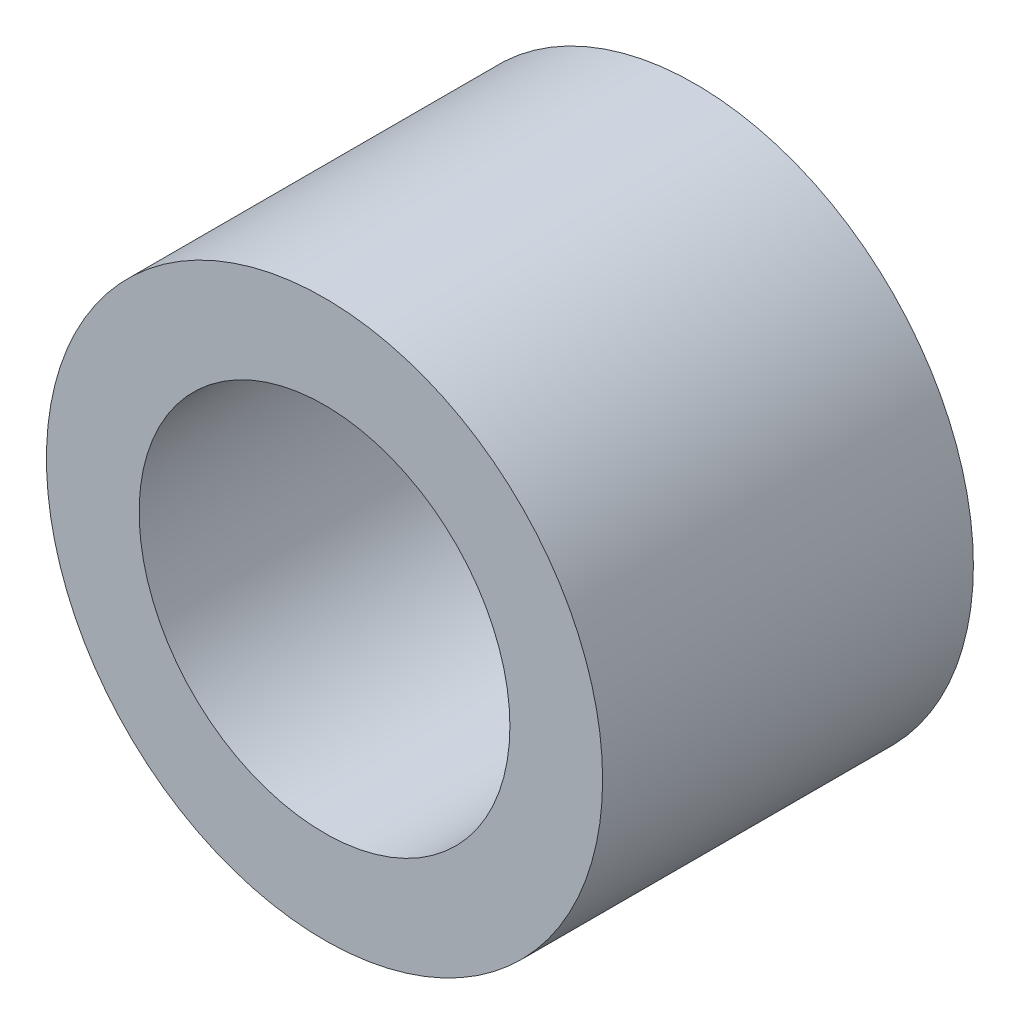
ISO-10303-21;
HEADER;
FILE_DESCRIPTION(('STEP AP214'),'2;1');
FILE_NAME('part.step','',(''),(''),'','','');
FILE_SCHEMA(('AUTOMOTIVE_DESIGN { 1 0 10303 214 1 1 1 1 }'));
ENDSEC;
DATA;
#1=APPLICATION_CONTEXT('core data for automotive mechanical design processes');
#2=APPLICATION_PROTOCOL_DEFINITION('international standard','automotive_design',2000,#1);
#3=PRODUCT_CONTEXT('',#1,'mechanical');
#4=PRODUCT('Part','Part','',(#3));
#5=PRODUCT_RELATED_PRODUCT_CATEGORY('part','',(#4));
#6=PRODUCT_DEFINITION_FORMATION('','',#4);
#7=PRODUCT_DEFINITION_CONTEXT('part definition',#1,'design');
#8=PRODUCT_DEFINITION('design','',#6,#7);
#9=PRODUCT_DEFINITION_SHAPE('','',#8);
#10=(LENGTH_UNIT() NAMED_UNIT(*) SI_UNIT(.MILLI.,.METRE.));
#11=(NAMED_UNIT(*) PLANE_ANGLE_UNIT() SI_UNIT($,.RADIAN.));
#12=(NAMED_UNIT(*) SI_UNIT($,.STERADIAN.) SOLID_ANGLE_UNIT());
#13=UNCERTAINTY_MEASURE_WITH_UNIT(LENGTH_MEASURE(1.E-05),#10,'distance_accuracy_value','');
#14=(GEOMETRIC_REPRESENTATION_CONTEXT(3) GLOBAL_UNCERTAINTY_ASSIGNED_CONTEXT((#13)) GLOBAL_UNIT_ASSIGNED_CONTEXT((#10,
#11,#12)) REPRESENTATION_CONTEXT('',''));
#15=CARTESIAN_POINT('',(0.,0.,0.));
#16=DIRECTION('',(0.,0.,1.));
#17=DIRECTION('',(1.,0.,0.));
#18=AXIS2_PLACEMENT_3D('',#15,#16,#17);
#19=CARTESIAN_POINT('',(0.,0.,4.));
#20=DIRECTION('',(0.,0.,1.));
#21=DIRECTION('',(1.,0.,0.));
#22=AXIS2_PLACEMENT_3D('',#19,#20,#21);
#23=PLANE('',#22);
#24=CARTESIAN_POINT('',(0.,0.,4.));
#25=DIRECTION('',(0.,0.,1.));
#26=DIRECTION('',(1.,0.,0.));
#27=AXIS2_PLACEMENT_3D('',#24,#25,#26);
#28=CIRCLE('',#27,3.);
#29=CARTESIAN_POINT('',(3.,0.,4.));
#30=VERTEX_POINT('',#29);
#31=EDGE_CURVE('E10',#30,#30,#28,.T.);
#32=ORIENTED_EDGE('',*,*,#31,.T.);
#33=EDGE_LOOP('',(#32));
#34=FACE_BOUND('',#33,.T.);
#35=CARTESIAN_POINT('',(0.,0.,4.));
#36=DIRECTION('',(0.,0.,1.));
#37=DIRECTION('',(1.,0.,0.));
#38=AXIS2_PLACEMENT_3D('',#35,#36,#37);
#39=CIRCLE('',#38,2.);
#40=CARTESIAN_POINT('',(2.,0.,4.));
#41=VERTEX_POINT('',#40);
#42=EDGE_CURVE('E37',#41,#41,#39,.T.);
#43=ORIENTED_EDGE('',*,*,#42,.F.);
#44=EDGE_LOOP('',(#43));
#45=FACE_BOUND('',#44,.T.);
#46=ADVANCED_FACE('F26',(#34,#45),#23,.T.);
#47=CARTESIAN_POINT('',(0.,0.,0.));
#48=DIRECTION('',(0.,0.,1.));
#49=DIRECTION('',(1.,0.,0.));
#50=AXIS2_PLACEMENT_3D('',#47,#48,#49);
#51=PLANE('',#50);
#52=CARTESIAN_POINT('',(0.,0.,0.));
#53=DIRECTION('',(0.,0.,1.));
#54=DIRECTION('',(1.,0.,0.));
#55=AXIS2_PLACEMENT_3D('',#52,#53,#54);
#56=CIRCLE('',#55,3.);
#57=CARTESIAN_POINT('',(3.,0.,0.));
#58=VERTEX_POINT('',#57);
#59=EDGE_CURVE('E33',#58,#58,#56,.T.);
#60=ORIENTED_EDGE('',*,*,#59,.F.);
#61=EDGE_LOOP('',(#60));
#62=FACE_BOUND('',#61,.T.);
#63=CARTESIAN_POINT('',(0.,0.,0.));
#64=DIRECTION('',(0.,0.,1.));
#65=DIRECTION('',(1.,0.,0.));
#66=AXIS2_PLACEMENT_3D('',#63,#64,#65);
#67=CIRCLE('',#66,2.);
#68=CARTESIAN_POINT('',(2.,0.,0.));
#69=VERTEX_POINT('',#68);
#70=EDGE_CURVE('E41',#69,#69,#67,.T.);
#71=ORIENTED_EDGE('',*,*,#70,.T.);
#72=EDGE_LOOP('',(#71));
#73=FACE_BOUND('',#72,.T.);
#74=ADVANCED_FACE('F47',(#62,#73),#51,.F.);
#75=CARTESIAN_POINT('',(0.,0.,4.));
#76=DIRECTION('',(0.,0.,-1.));
#77=DIRECTION('',(-1.,0.,0.));
#78=AXIS2_PLACEMENT_3D('',#75,#76,#77);
#79=CYLINDRICAL_SURFACE('',#78,3.);
#80=ORIENTED_EDGE('',*,*,#31,.F.);
#81=EDGE_LOOP('',(#80));
#82=FACE_BOUND('',#81,.T.);
#83=ORIENTED_EDGE('',*,*,#59,.T.);
#84=EDGE_LOOP('',(#83));
#85=FACE_BOUND('',#84,.T.);
#86=ADVANCED_FACE('F28',(#82,#85),#79,.T.);
#87=CARTESIAN_POINT('',(0.,0.,4.));
#88=DIRECTION('',(0.,0.,-1.));
#89=DIRECTION('',(-1.,0.,0.));
#90=AXIS2_PLACEMENT_3D('',#87,#88,#89);
#91=CYLINDRICAL_SURFACE('',#90,2.);
#92=ORIENTED_EDGE('',*,*,#42,.T.);
#93=EDGE_LOOP('',(#92));
#94=FACE_BOUND('',#93,.T.);
#95=ORIENTED_EDGE('',*,*,#70,.F.);
#96=EDGE_LOOP('',(#95));
#97=FACE_BOUND('',#96,.T.);
#98=ADVANCED_FACE('F49',(#94,#97),#91,.F.);
#99=CLOSED_SHELL('',(#46,#74,#86,#98));
#100=MANIFOLD_SOLID_BREP('B2',#99);
#101=ADVANCED_BREP_SHAPE_REPRESENTATION('',(#18,#100),#14);
#102=SHAPE_DEFINITION_REPRESENTATION(#9,#101);
ENDSEC;
END-ISO-10303-21;
